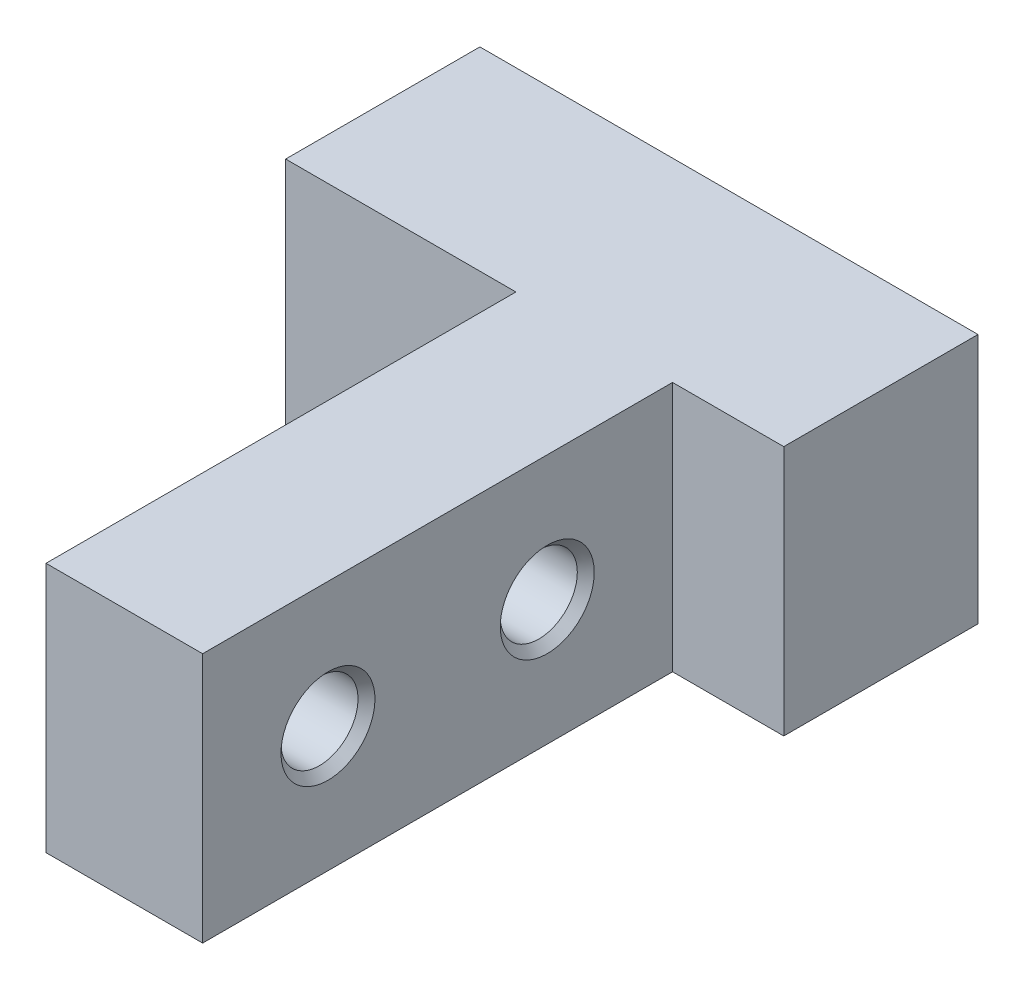
ISO-10303-21;
HEADER;
FILE_DESCRIPTION(('STEP AP214'),'2;1');
FILE_NAME('part.step','',(''),(''),'','','');
FILE_SCHEMA(('AUTOMOTIVE_DESIGN { 1 0 10303 214 1 1 1 1 }'));
ENDSEC;
DATA;
#1=APPLICATION_CONTEXT('core data for automotive mechanical design processes');
#2=APPLICATION_PROTOCOL_DEFINITION('international standard','automotive_design',2000,#1);
#3=PRODUCT_CONTEXT('',#1,'mechanical');
#4=PRODUCT('Part','Part','',(#3));
#5=PRODUCT_RELATED_PRODUCT_CATEGORY('part','',(#4));
#6=PRODUCT_DEFINITION_FORMATION('','',#4);
#7=PRODUCT_DEFINITION_CONTEXT('part definition',#1,'design');
#8=PRODUCT_DEFINITION('design','',#6,#7);
#9=PRODUCT_DEFINITION_SHAPE('','',#8);
#10=(LENGTH_UNIT() NAMED_UNIT(*) SI_UNIT(.MILLI.,.METRE.));
#11=(NAMED_UNIT(*) PLANE_ANGLE_UNIT() SI_UNIT($,.RADIAN.));
#12=(NAMED_UNIT(*) SI_UNIT($,.STERADIAN.) SOLID_ANGLE_UNIT());
#13=UNCERTAINTY_MEASURE_WITH_UNIT(LENGTH_MEASURE(1.E-05),#10,'distance_accuracy_value','');
#14=(GEOMETRIC_REPRESENTATION_CONTEXT(3) GLOBAL_UNCERTAINTY_ASSIGNED_CONTEXT((#13)) GLOBAL_UNIT_ASSIGNED_CONTEXT((#10,
#11,#12)) REPRESENTATION_CONTEXT('',''));
#15=CARTESIAN_POINT('',(0.,0.,0.));
#16=DIRECTION('',(0.,0.,1.));
#17=DIRECTION('',(1.,0.,0.));
#18=AXIS2_PLACEMENT_3D('',#15,#16,#17);
#19=CARTESIAN_POINT('',(9.95,0.,6.3));
#20=DIRECTION('',(-1.,0.,0.));
#21=DIRECTION('',(0.,0.,1.));
#22=AXIS2_PLACEMENT_3D('',#19,#20,#21);
#23=CYLINDRICAL_SURFACE('',#22,1.23);
#24=CARTESIAN_POINT('',(12.1799999999439,0.,6.3));
#25=DIRECTION('',(1.,0.,0.));
#26=DIRECTION('',(0.,0.,1.));
#27=AXIS2_PLACEMENT_3D('',#24,#25,#26);
#28=CIRCLE('',#27,1.22999999997428);
#29=CARTESIAN_POINT('',(12.1799999999439,0.,7.52999999997428));
#30=VERTEX_POINT('',#29);
#31=EDGE_CURVE('E121',#30,#30,#28,.T.);
#32=ORIENTED_EDGE('',*,*,#31,.T.);
#33=EDGE_LOOP('',(#32));
#34=FACE_BOUND('',#33,.T.);
#35=CARTESIAN_POINT('',(7.72000000006301,0.,6.3));
#36=DIRECTION('',(-1.,0.,0.));
#37=DIRECTION('',(0.,0.,1.));
#38=AXIS2_PLACEMENT_3D('',#35,#36,#37);
#39=CIRCLE('',#38,1.23000000008797);
#40=CARTESIAN_POINT('',(7.72000000006301,0.,7.53000000008797));
#41=VERTEX_POINT('',#40);
#42=EDGE_CURVE('E115',#41,#41,#39,.T.);
#43=ORIENTED_EDGE('',*,*,#42,.T.);
#44=EDGE_LOOP('',(#43));
#45=FACE_BOUND('',#44,.T.);
#46=ADVANCED_FACE('F17',(#34,#45),#23,.F.);
#47=CARTESIAN_POINT('',(9.95,0.,13.3));
#48=DIRECTION('',(-1.,0.,0.));
#49=DIRECTION('',(0.,0.,1.));
#50=AXIS2_PLACEMENT_3D('',#47,#48,#49);
#51=CYLINDRICAL_SURFACE('',#50,1.23);
#52=CARTESIAN_POINT('',(12.1800000000007,0.,13.3));
#53=DIRECTION('',(1.,0.,0.));
#54=DIRECTION('',(0.,0.,1.));
#55=AXIS2_PLACEMENT_3D('',#52,#53,#54);
#56=CIRCLE('',#55,1.23000000003612);
#57=CARTESIAN_POINT('',(12.1800000000007,0.,14.5300000000361));
#58=VERTEX_POINT('',#57);
#59=EDGE_CURVE('E118',#58,#58,#56,.T.);
#60=ORIENTED_EDGE('',*,*,#59,.T.);
#61=EDGE_LOOP('',(#60));
#62=FACE_BOUND('',#61,.T.);
#63=CARTESIAN_POINT('',(7.72000000000617,0.,13.3));
#64=DIRECTION('',(-1.,0.,0.));
#65=DIRECTION('',(0.,0.,1.));
#66=AXIS2_PLACEMENT_3D('',#63,#64,#65);
#67=CIRCLE('',#66,1.23000000003612);
#68=CARTESIAN_POINT('',(7.72000000000617,0.,14.5300000000361));
#69=VERTEX_POINT('',#68);
#70=EDGE_CURVE('E104',#69,#69,#67,.T.);
#71=ORIENTED_EDGE('',*,*,#70,.T.);
#72=EDGE_LOOP('',(#71));
#73=FACE_BOUND('',#72,.T.);
#74=ADVANCED_FACE('F140',(#62,#73),#51,.F.);
#75=CARTESIAN_POINT('',(12.4499999999443,0.,6.3));
#76=DIRECTION('',(1.,0.,0.));
#77=DIRECTION('',(0.,0.,-1.));
#78=AXIS2_PLACEMENT_3D('',#75,#76,#77);
#79=CONICAL_SURFACE('',#78,1.49999999997472,0.785398163397448);
#80=ORIENTED_EDGE('',*,*,#31,.F.);
#81=EDGE_LOOP('',(#80));
#82=FACE_BOUND('',#81,.T.);
#83=CARTESIAN_POINT('',(12.4499999999443,0.,6.3));
#84=DIRECTION('',(1.,0.,0.));
#85=DIRECTION('',(0.,0.,-1.));
#86=AXIS2_PLACEMENT_3D('',#83,#84,#85);
#87=CIRCLE('',#86,1.49999999997472);
#88=CARTESIAN_POINT('',(12.4499999999443,0.,4.80000000002528));
#89=VERTEX_POINT('',#88);
#90=EDGE_CURVE('E20',#89,#89,#87,.F.);
#91=ORIENTED_EDGE('',*,*,#90,.F.);
#92=EDGE_LOOP('',(#91));
#93=FACE_BOUND('',#92,.T.);
#94=ADVANCED_FACE('F137',(#82,#93),#79,.F.);
#95=CARTESIAN_POINT('',(12.4499999998875,0.,13.3));
#96=DIRECTION('',(1.,0.,0.));
#97=DIRECTION('',(0.,1.,0.));
#98=AXIS2_PLACEMENT_3D('',#95,#96,#97);
#99=CONICAL_SURFACE('',#98,1.49999999997972,0.785398163502714);
#100=ORIENTED_EDGE('',*,*,#59,.F.);
#101=EDGE_LOOP('',(#100));
#102=FACE_BOUND('',#101,.T.);
#103=CARTESIAN_POINT('',(12.4499999999292,0.,13.3));
#104=DIRECTION('',(1.,0.,0.));
#105=DIRECTION('',(0.,1.,0.));
#106=AXIS2_PLACEMENT_3D('',#103,#104,#105);
#107=CIRCLE('',#106,1.50000000002137);
#108=CARTESIAN_POINT('',(12.4499999999292,1.50000000002137,13.3));
#109=VERTEX_POINT('',#108);
#110=EDGE_CURVE('E93',#109,#109,#107,.F.);
#111=ORIENTED_EDGE('',*,*,#110,.F.);
#112=EDGE_LOOP('',(#111));
#113=FACE_BOUND('',#112,.T.);
#114=ADVANCED_FACE('F139',(#102,#113),#99,.F.);
#115=CARTESIAN_POINT('',(7.45000000006257,0.,6.3));
#116=DIRECTION('',(-1.,0.,0.));
#117=DIRECTION('',(0.,0.,1.));
#118=AXIS2_PLACEMENT_3D('',#115,#116,#117);
#119=CONICAL_SURFACE('',#118,1.5000000000884,0.785398163397448);
#120=ORIENTED_EDGE('',*,*,#42,.F.);
#121=EDGE_LOOP('',(#120));
#122=FACE_BOUND('',#121,.T.);
#123=CARTESIAN_POINT('',(7.45000000006257,0.,6.3));
#124=DIRECTION('',(-1.,0.,0.));
#125=DIRECTION('',(0.,0.,1.));
#126=AXIS2_PLACEMENT_3D('',#123,#124,#125);
#127=CIRCLE('',#126,1.5000000000884);
#128=CARTESIAN_POINT('',(7.45000000006257,0.,7.8000000000884));
#129=VERTEX_POINT('',#128);
#130=EDGE_CURVE('E128',#129,#129,#127,.F.);
#131=ORIENTED_EDGE('',*,*,#130,.F.);
#132=EDGE_LOOP('',(#131));
#133=FACE_BOUND('',#132,.T.);
#134=ADVANCED_FACE('F148',(#122,#133),#119,.F.);
#135=CARTESIAN_POINT('',(7.45000000006257,0.,13.3));
#136=DIRECTION('',(-1.,0.,0.));
#137=DIRECTION('',(0.,0.,1.));
#138=AXIS2_PLACEMENT_3D('',#135,#136,#137);
#139=CONICAL_SURFACE('',#138,1.49999999997972,0.785398163397448);
#140=ORIENTED_EDGE('',*,*,#70,.F.);
#141=EDGE_LOOP('',(#140));
#142=FACE_BOUND('',#141,.T.);
#143=CARTESIAN_POINT('',(7.45000000006257,0.,13.3));
#144=DIRECTION('',(-1.,0.,0.));
#145=DIRECTION('',(0.,0.,1.));
#146=AXIS2_PLACEMENT_3D('',#143,#144,#145);
#147=CIRCLE('',#146,1.49999999997972);
#148=CARTESIAN_POINT('',(7.45000000006257,0.,14.7999999999797));
#149=VERTEX_POINT('',#148);
#150=EDGE_CURVE('E124',#149,#149,#147,.F.);
#151=ORIENTED_EDGE('',*,*,#150,.F.);
#152=EDGE_LOOP('',(#151));
#153=FACE_BOUND('',#152,.T.);
#154=ADVANCED_FACE('F189',(#142,#153),#139,.F.);
#155=CARTESIAN_POINT('',(0.,4.,0.));
#156=DIRECTION('',(0.,1.,0.));
#157=DIRECTION('',(0.,0.,1.));
#158=AXIS2_PLACEMENT_3D('',#155,#156,#157);
#159=PLANE('',#158);
#160=DIRECTION('',(-1.,0.,0.));
#161=VECTOR('',#160,1.);
#162=CARTESIAN_POINT('',(16.,4.,-3.90000000000002));
#163=LINE('',#162,#161);
#164=CARTESIAN_POINT('',(0.100000000000005,4.,-3.90000000000001));
#165=VERTEX_POINT('',#164);
#166=CARTESIAN_POINT('',(16.,4.,-3.90000000000002));
#167=VERTEX_POINT('',#166);
#168=EDGE_CURVE('E317',#165,#167,#163,.F.);
#169=ORIENTED_EDGE('',*,*,#168,.F.);
#170=DIRECTION('',(0.,0.,1.));
#171=VECTOR('',#170,1.);
#172=CARTESIAN_POINT('',(0.100000000000005,4.,-3.9));
#173=LINE('',#172,#171);
#174=CARTESIAN_POINT('',(0.100000000000002,4.,2.3));
#175=VERTEX_POINT('',#174);
#176=EDGE_CURVE('E337',#175,#165,#173,.F.);
#177=ORIENTED_EDGE('',*,*,#176,.F.);
#178=DIRECTION('',(1.,0.,0.));
#179=VECTOR('',#178,1.);
#180=CARTESIAN_POINT('',(0.0999999999999996,4.,2.3));
#181=LINE('',#180,#179);
#182=CARTESIAN_POINT('',(7.45,4.,2.3));
#183=VERTEX_POINT('',#182);
#184=EDGE_CURVE('E333',#183,#175,#181,.F.);
#185=ORIENTED_EDGE('',*,*,#184,.F.);
#186=DIRECTION('',(0.,0.,1.));
#187=VECTOR('',#186,1.);
#188=CARTESIAN_POINT('',(7.45,4.,2.29999999999999));
#189=LINE('',#188,#187);
#190=CARTESIAN_POINT('',(7.45,4.,17.3));
#191=VERTEX_POINT('',#190);
#192=EDGE_CURVE('E100',#191,#183,#189,.F.);
#193=ORIENTED_EDGE('',*,*,#192,.F.);
#194=DIRECTION('',(1.,0.,0.));
#195=VECTOR('',#194,1.);
#196=CARTESIAN_POINT('',(7.45,4.,17.3));
#197=LINE('',#196,#195);
#198=CARTESIAN_POINT('',(12.45,4.,17.3));
#199=VERTEX_POINT('',#198);
#200=EDGE_CURVE('E96',#199,#191,#197,.F.);
#201=ORIENTED_EDGE('',*,*,#200,.F.);
#202=DIRECTION('',(0.,0.,-1.));
#203=VECTOR('',#202,1.);
#204=CARTESIAN_POINT('',(12.45,4.,17.3));
#205=LINE('',#204,#203);
#206=CARTESIAN_POINT('',(12.45,4.,2.3));
#207=VERTEX_POINT('',#206);
#208=EDGE_CURVE('E83',#207,#199,#205,.F.);
#209=ORIENTED_EDGE('',*,*,#208,.F.);
#210=DIRECTION('',(1.,0.,0.));
#211=VECTOR('',#210,1.);
#212=CARTESIAN_POINT('',(12.45,4.,2.3));
#213=LINE('',#212,#211);
#214=CARTESIAN_POINT('',(16.,4.,2.3));
#215=VERTEX_POINT('',#214);
#216=EDGE_CURVE('E78',#215,#207,#213,.F.);
#217=ORIENTED_EDGE('',*,*,#216,.F.);
#218=DIRECTION('',(0.,0.,-1.));
#219=VECTOR('',#218,1.);
#220=CARTESIAN_POINT('',(16.,4.,2.3));
#221=LINE('',#220,#219);
#222=EDGE_CURVE('E308',#167,#215,#221,.F.);
#223=ORIENTED_EDGE('',*,*,#222,.F.);
#224=EDGE_LOOP('',(#169,#177,#185,#193,#201,#209,#217,#223));
#225=FACE_BOUND('',#224,.T.);
#226=ADVANCED_FACE('F98',(#225),#159,.T.);
#227=CARTESIAN_POINT('',(7.45,4.,17.3));
#228=DIRECTION('',(0.,0.,1.));
#229=DIRECTION('',(1.,0.,0.));
#230=AXIS2_PLACEMENT_3D('',#227,#228,#229);
#231=PLANE('',#230);
#232=ORIENTED_EDGE('',*,*,#200,.T.);
#233=DIRECTION('',(0.,1.,0.));
#234=VECTOR('',#233,1.);
#235=CARTESIAN_POINT('',(7.45,4.,17.3));
#236=LINE('',#235,#234);
#237=CARTESIAN_POINT('',(7.45,-4.,17.3));
#238=VERTEX_POINT('',#237);
#239=EDGE_CURVE('E127',#238,#191,#236,.T.);
#240=ORIENTED_EDGE('',*,*,#239,.F.);
#241=DIRECTION('',(1.,0.,0.));
#242=VECTOR('',#241,1.);
#243=CARTESIAN_POINT('',(0.,-4.,17.3));
#244=LINE('',#243,#242);
#245=CARTESIAN_POINT('',(12.45,-4.,17.3));
#246=VERTEX_POINT('',#245);
#247=EDGE_CURVE('E108',#238,#246,#244,.T.);
#248=ORIENTED_EDGE('',*,*,#247,.T.);
#249=DIRECTION('',(0.,1.,0.));
#250=VECTOR('',#249,1.);
#251=CARTESIAN_POINT('',(12.45,4.,17.3));
#252=LINE('',#251,#250);
#253=EDGE_CURVE('E89',#199,#246,#252,.F.);
#254=ORIENTED_EDGE('',*,*,#253,.F.);
#255=EDGE_LOOP('',(#232,#240,#248,#254));
#256=FACE_BOUND('',#255,.T.);
#257=ADVANCED_FACE('F107',(#256),#231,.T.);
#258=CARTESIAN_POINT('',(12.45,4.,17.3));
#259=DIRECTION('',(1.,0.,0.));
#260=DIRECTION('',(0.,0.,-1.));
#261=AXIS2_PLACEMENT_3D('',#258,#259,#260);
#262=PLANE('',#261);
#263=ORIENTED_EDGE('',*,*,#208,.T.);
#264=ORIENTED_EDGE('',*,*,#253,.T.);
#265=DIRECTION('',(0.,0.,1.));
#266=VECTOR('',#265,1.);
#267=CARTESIAN_POINT('',(12.45,-4.,0.));
#268=LINE('',#267,#266);
#269=CARTESIAN_POINT('',(12.45,-4.,2.3));
#270=VERTEX_POINT('',#269);
#271=EDGE_CURVE('E321',#246,#270,#268,.F.);
#272=ORIENTED_EDGE('',*,*,#271,.T.);
#273=DIRECTION('',(0.,1.,0.));
#274=VECTOR('',#273,1.);
#275=CARTESIAN_POINT('',(12.45,4.,2.3));
#276=LINE('',#275,#274);
#277=EDGE_CURVE('E91',#207,#270,#276,.F.);
#278=ORIENTED_EDGE('',*,*,#277,.F.);
#279=EDGE_LOOP('',(#263,#264,#272,#278));
#280=FACE_BOUND('',#279,.T.);
#281=ORIENTED_EDGE('',*,*,#110,.T.);
#282=EDGE_LOOP('',(#281));
#283=FACE_BOUND('',#282,.T.);
#284=ORIENTED_EDGE('',*,*,#90,.T.);
#285=EDGE_LOOP('',(#284));
#286=FACE_BOUND('',#285,.T.);
#287=ADVANCED_FACE('F85',(#280,#283,#286),#262,.T.);
#288=CARTESIAN_POINT('',(12.45,4.,2.3));
#289=DIRECTION('',(0.,0.,1.));
#290=DIRECTION('',(1.,0.,0.));
#291=AXIS2_PLACEMENT_3D('',#288,#289,#290);
#292=PLANE('',#291);
#293=ORIENTED_EDGE('',*,*,#216,.T.);
#294=ORIENTED_EDGE('',*,*,#277,.T.);
#295=DIRECTION('',(1.,0.,0.));
#296=VECTOR('',#295,1.);
#297=CARTESIAN_POINT('',(0.,-4.,2.3));
#298=LINE('',#297,#296);
#299=CARTESIAN_POINT('',(16.,-4.,2.3));
#300=VERTEX_POINT('',#299);
#301=EDGE_CURVE('E316',#270,#300,#298,.T.);
#302=ORIENTED_EDGE('',*,*,#301,.T.);
#303=DIRECTION('',(0.,1.,0.));
#304=VECTOR('',#303,1.);
#305=CARTESIAN_POINT('',(16.,4.,2.3));
#306=LINE('',#305,#304);
#307=EDGE_CURVE('E310',#215,#300,#306,.F.);
#308=ORIENTED_EDGE('',*,*,#307,.F.);
#309=EDGE_LOOP('',(#293,#294,#302,#308));
#310=FACE_BOUND('',#309,.T.);
#311=ADVANCED_FACE('F179',(#310),#292,.T.);
#312=CARTESIAN_POINT('',(16.,4.,2.3));
#313=DIRECTION('',(1.,0.,0.));
#314=DIRECTION('',(0.,0.,-1.));
#315=AXIS2_PLACEMENT_3D('',#312,#313,#314);
#316=PLANE('',#315);
#317=ORIENTED_EDGE('',*,*,#222,.T.);
#318=ORIENTED_EDGE('',*,*,#307,.T.);
#319=DIRECTION('',(0.,0.,1.));
#320=VECTOR('',#319,1.);
#321=CARTESIAN_POINT('',(16.,-4.,0.));
#322=LINE('',#321,#320);
#323=CARTESIAN_POINT('',(16.,-4.,-3.90000000000002));
#324=VERTEX_POINT('',#323);
#325=EDGE_CURVE('E323',#300,#324,#322,.F.);
#326=ORIENTED_EDGE('',*,*,#325,.T.);
#327=DIRECTION('',(0.,1.,0.));
#328=VECTOR('',#327,1.);
#329=CARTESIAN_POINT('',(16.,4.,-3.90000000000002));
#330=LINE('',#329,#328);
#331=EDGE_CURVE('E312',#167,#324,#330,.F.);
#332=ORIENTED_EDGE('',*,*,#331,.F.);
#333=EDGE_LOOP('',(#317,#318,#326,#332));
#334=FACE_BOUND('',#333,.T.);
#335=ADVANCED_FACE('F175',(#334),#316,.T.);
#336=CARTESIAN_POINT('',(16.,4.,-3.90000000000002));
#337=DIRECTION('',(0.,0.,-1.));
#338=DIRECTION('',(-1.,0.,0.));
#339=AXIS2_PLACEMENT_3D('',#336,#337,#338);
#340=PLANE('',#339);
#341=ORIENTED_EDGE('',*,*,#168,.T.);
#342=ORIENTED_EDGE('',*,*,#331,.T.);
#343=DIRECTION('',(1.,0.,0.));
#344=VECTOR('',#343,1.);
#345=CARTESIAN_POINT('',(0.,-4.,-3.90000000000002));
#346=LINE('',#345,#344);
#347=CARTESIAN_POINT('',(0.100000000000006,-4.,-3.90000000000001));
#348=VERTEX_POINT('',#347);
#349=EDGE_CURVE('E340',#324,#348,#346,.F.);
#350=ORIENTED_EDGE('',*,*,#349,.T.);
#351=DIRECTION('',(0.,1.,0.));
#352=VECTOR('',#351,1.);
#353=CARTESIAN_POINT('',(0.100000000000005,4.,-3.9));
#354=LINE('',#353,#352);
#355=EDGE_CURVE('E335',#165,#348,#354,.F.);
#356=ORIENTED_EDGE('',*,*,#355,.F.);
#357=EDGE_LOOP('',(#341,#342,#350,#356));
#358=FACE_BOUND('',#357,.T.);
#359=ADVANCED_FACE('F171',(#358),#340,.T.);
#360=CARTESIAN_POINT('',(0.100000000000005,4.,-3.9));
#361=DIRECTION('',(-1.,0.,0.));
#362=DIRECTION('',(0.,0.,1.));
#363=AXIS2_PLACEMENT_3D('',#360,#361,#362);
#364=PLANE('',#363);
#365=ORIENTED_EDGE('',*,*,#176,.T.);
#366=ORIENTED_EDGE('',*,*,#355,.T.);
#367=DIRECTION('',(0.,0.,1.));
#368=VECTOR('',#367,1.);
#369=CARTESIAN_POINT('',(0.100000000000005,-4.,0.));
#370=LINE('',#369,#368);
#371=CARTESIAN_POINT('',(0.100000000000001,-4.,2.3));
#372=VERTEX_POINT('',#371);
#373=EDGE_CURVE('E343',#348,#372,#370,.T.);
#374=ORIENTED_EDGE('',*,*,#373,.T.);
#375=DIRECTION('',(0.,1.,0.));
#376=VECTOR('',#375,1.);
#377=CARTESIAN_POINT('',(0.0999999999999996,4.,2.3));
#378=LINE('',#377,#376);
#379=EDGE_CURVE('E130',#175,#372,#378,.F.);
#380=ORIENTED_EDGE('',*,*,#379,.F.);
#381=EDGE_LOOP('',(#365,#366,#374,#380));
#382=FACE_BOUND('',#381,.T.);
#383=ADVANCED_FACE('F167',(#382),#364,.T.);
#384=CARTESIAN_POINT('',(0.0999999999999996,4.,2.3));
#385=DIRECTION('',(0.,0.,1.));
#386=DIRECTION('',(1.,0.,0.));
#387=AXIS2_PLACEMENT_3D('',#384,#385,#386);
#388=PLANE('',#387);
#389=ORIENTED_EDGE('',*,*,#184,.T.);
#390=ORIENTED_EDGE('',*,*,#379,.T.);
#391=DIRECTION('',(1.,0.,0.));
#392=VECTOR('',#391,1.);
#393=CARTESIAN_POINT('',(0.,-4.,2.3));
#394=LINE('',#393,#392);
#395=CARTESIAN_POINT('',(7.45,-4.,2.29999999999999));
#396=VERTEX_POINT('',#395);
#397=EDGE_CURVE('E26',#372,#396,#394,.T.);
#398=ORIENTED_EDGE('',*,*,#397,.T.);
#399=DIRECTION('',(0.,1.,0.));
#400=VECTOR('',#399,1.);
#401=CARTESIAN_POINT('',(7.45,4.,2.29999999999999));
#402=LINE('',#401,#400);
#403=EDGE_CURVE('E34',#183,#396,#402,.F.);
#404=ORIENTED_EDGE('',*,*,#403,.F.);
#405=EDGE_LOOP('',(#389,#390,#398,#404));
#406=FACE_BOUND('',#405,.T.);
#407=ADVANCED_FACE('F161',(#406),#388,.T.);
#408=CARTESIAN_POINT('',(7.45,4.,2.29999999999999));
#409=DIRECTION('',(-1.,0.,0.));
#410=DIRECTION('',(0.,0.,1.));
#411=AXIS2_PLACEMENT_3D('',#408,#409,#410);
#412=PLANE('',#411);
#413=ORIENTED_EDGE('',*,*,#192,.T.);
#414=ORIENTED_EDGE('',*,*,#403,.T.);
#415=DIRECTION('',(0.,0.,1.));
#416=VECTOR('',#415,1.);
#417=CARTESIAN_POINT('',(7.45,-4.,0.));
#418=LINE('',#417,#416);
#419=EDGE_CURVE('E11',#396,#238,#418,.T.);
#420=ORIENTED_EDGE('',*,*,#419,.T.);
#421=ORIENTED_EDGE('',*,*,#239,.T.);
#422=EDGE_LOOP('',(#413,#414,#420,#421));
#423=FACE_BOUND('',#422,.T.);
#424=ORIENTED_EDGE('',*,*,#150,.T.);
#425=EDGE_LOOP('',(#424));
#426=FACE_BOUND('',#425,.T.);
#427=ORIENTED_EDGE('',*,*,#130,.T.);
#428=EDGE_LOOP('',(#427));
#429=FACE_BOUND('',#428,.T.);
#430=ADVANCED_FACE('F155',(#423,#426,#429),#412,.T.);
#431=CARTESIAN_POINT('',(0.,-4.,0.));
#432=DIRECTION('',(0.,1.,0.));
#433=DIRECTION('',(0.,0.,1.));
#434=AXIS2_PLACEMENT_3D('',#431,#432,#433);
#435=PLANE('',#434);
#436=ORIENTED_EDGE('',*,*,#397,.F.);
#437=ORIENTED_EDGE('',*,*,#373,.F.);
#438=ORIENTED_EDGE('',*,*,#349,.F.);
#439=ORIENTED_EDGE('',*,*,#325,.F.);
#440=ORIENTED_EDGE('',*,*,#301,.F.);
#441=ORIENTED_EDGE('',*,*,#271,.F.);
#442=ORIENTED_EDGE('',*,*,#247,.F.);
#443=ORIENTED_EDGE('',*,*,#419,.F.);
#444=EDGE_LOOP('',(#436,#437,#438,#439,#440,#441,#442,#443));
#445=FACE_BOUND('',#444,.T.);
#446=ADVANCED_FACE('F153',(#445),#435,.F.);
#447=CLOSED_SHELL('',(#46,#74,#94,#114,#134,#154,#226,#257,#287,#311,#335,#359,#383,#407,#430,#446));
#448=MANIFOLD_SOLID_BREP('B1',#447);
#449=ADVANCED_BREP_SHAPE_REPRESENTATION('',(#18,#448),#14);
#450=SHAPE_DEFINITION_REPRESENTATION(#9,#449);
ENDSEC;
END-ISO-10303-21;
